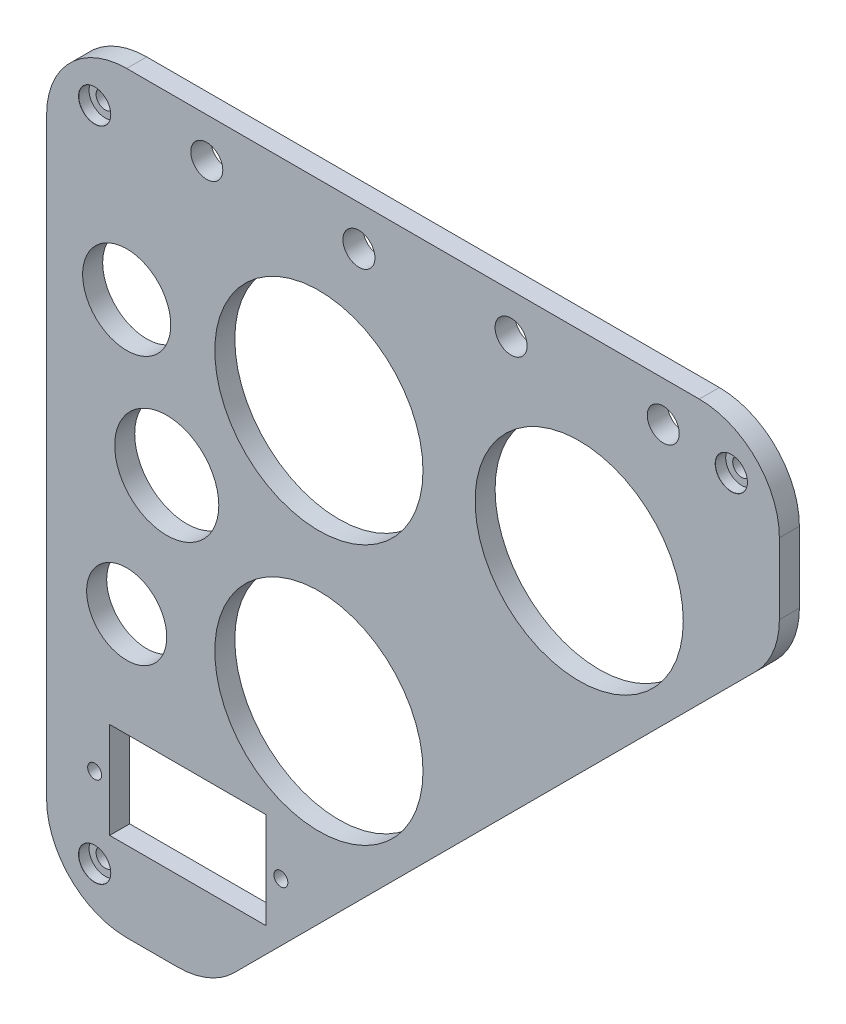
ISO-10303-21;
HEADER;
FILE_DESCRIPTION(('STEP AP214'),'2;1');
FILE_NAME('part.step','',(''),(''),'','','');
FILE_SCHEMA(('AUTOMOTIVE_DESIGN { 1 0 10303 214 1 1 1 1 }'));
ENDSEC;
DATA;
#1=APPLICATION_CONTEXT('core data for automotive mechanical design processes');
#2=APPLICATION_PROTOCOL_DEFINITION('international standard','automotive_design',2000,#1);
#3=PRODUCT_CONTEXT('',#1,'mechanical');
#4=PRODUCT('Part','Part','',(#3));
#5=PRODUCT_RELATED_PRODUCT_CATEGORY('part','',(#4));
#6=PRODUCT_DEFINITION_FORMATION('','',#4);
#7=PRODUCT_DEFINITION_CONTEXT('part definition',#1,'design');
#8=PRODUCT_DEFINITION('design','',#6,#7);
#9=PRODUCT_DEFINITION_SHAPE('','',#8);
#10=(LENGTH_UNIT() NAMED_UNIT(*) SI_UNIT(.MILLI.,.METRE.));
#11=(NAMED_UNIT(*) PLANE_ANGLE_UNIT() SI_UNIT($,.RADIAN.));
#12=(NAMED_UNIT(*) SI_UNIT($,.STERADIAN.) SOLID_ANGLE_UNIT());
#13=UNCERTAINTY_MEASURE_WITH_UNIT(LENGTH_MEASURE(1.E-05),#10,'distance_accuracy_value','');
#14=(GEOMETRIC_REPRESENTATION_CONTEXT(3) GLOBAL_UNCERTAINTY_ASSIGNED_CONTEXT((#13)) GLOBAL_UNIT_ASSIGNED_CONTEXT((#10,
#11,#12)) REPRESENTATION_CONTEXT('',''));
#15=CARTESIAN_POINT('',(0.,0.,0.));
#16=DIRECTION('',(0.,0.,1.));
#17=DIRECTION('',(1.,0.,0.));
#18=AXIS2_PLACEMENT_3D('',#15,#16,#17);
#19=CARTESIAN_POINT('',(20.,168.000000000002,5.));
#20=DIRECTION('',(0.,0.,-1.));
#21=DIRECTION('',(-1.,0.,0.));
#22=AXIS2_PLACEMENT_3D('',#19,#20,#21);
#23=CYLINDRICAL_SURFACE('',#22,20.);
#24=CARTESIAN_POINT('',(20.,168.000000000002,0.));
#25=DIRECTION('',(0.,0.,1.));
#26=DIRECTION('',(-1.,0.,0.));
#27=AXIS2_PLACEMENT_3D('',#24,#25,#26);
#28=CIRCLE('',#27,20.);
#29=CARTESIAN_POINT('',(20.,188.000000000002,0.));
#30=VERTEX_POINT('',#29);
#31=CARTESIAN_POINT('',(0.,168.000000000002,0.));
#32=VERTEX_POINT('',#31);
#33=EDGE_CURVE('E209',#30,#32,#28,.T.);
#34=ORIENTED_EDGE('',*,*,#33,.T.);
#35=DIRECTION('',(0.,0.,-1.));
#36=VECTOR('',#35,1.);
#37=CARTESIAN_POINT('',(0.,168.000000000002,5.));
#38=LINE('',#37,#36);
#39=CARTESIAN_POINT('',(0.,168.000000000002,5.));
#40=VERTEX_POINT('',#39);
#41=EDGE_CURVE('E278',#40,#32,#38,.T.);
#42=ORIENTED_EDGE('',*,*,#41,.F.);
#43=CARTESIAN_POINT('',(20.,168.000000000002,5.));
#44=DIRECTION('',(0.,0.,1.));
#45=DIRECTION('',(-1.,0.,0.));
#46=AXIS2_PLACEMENT_3D('',#43,#44,#45);
#47=CIRCLE('',#46,20.);
#48=CARTESIAN_POINT('',(20.,188.000000000002,5.));
#49=VERTEX_POINT('',#48);
#50=EDGE_CURVE('E210',#49,#40,#47,.T.);
#51=ORIENTED_EDGE('',*,*,#50,.F.);
#52=DIRECTION('',(0.,0.,-1.));
#53=VECTOR('',#52,1.);
#54=CARTESIAN_POINT('',(20.,188.000000000002,5.));
#55=LINE('',#54,#53);
#56=EDGE_CURVE('E232',#49,#30,#55,.T.);
#57=ORIENTED_EDGE('',*,*,#56,.T.);
#58=EDGE_LOOP('',(#34,#42,#51,#57));
#59=FACE_BOUND('',#58,.T.);
#60=ADVANCED_FACE('F34',(#59),#23,.T.);
#61=CARTESIAN_POINT('',(0.,20.0000000000001,5.));
#62=DIRECTION('',(1.,0.,0.));
#63=DIRECTION('',(0.,0.,-1.));
#64=AXIS2_PLACEMENT_3D('',#61,#62,#63);
#65=PLANE('',#64);
#66=DIRECTION('',(0.,-1.,0.));
#67=VECTOR('',#66,1.);
#68=CARTESIAN_POINT('',(0.,20.0000000000001,0.));
#69=LINE('',#68,#67);
#70=CARTESIAN_POINT('',(0.,20.0000000000001,0.));
#71=VERTEX_POINT('',#70);
#72=EDGE_CURVE('E235',#32,#71,#69,.T.);
#73=ORIENTED_EDGE('',*,*,#72,.T.);
#74=DIRECTION('',(0.,0.,-1.));
#75=VECTOR('',#74,1.);
#76=CARTESIAN_POINT('',(0.,20.0000000000001,5.));
#77=LINE('',#76,#75);
#78=CARTESIAN_POINT('',(0.,20.0000000000001,5.));
#79=VERTEX_POINT('',#78);
#80=EDGE_CURVE('E275',#79,#71,#77,.T.);
#81=ORIENTED_EDGE('',*,*,#80,.F.);
#82=DIRECTION('',(0.,-1.,0.));
#83=VECTOR('',#82,1.);
#84=CARTESIAN_POINT('',(0.,20.0000000000001,5.));
#85=LINE('',#84,#83);
#86=EDGE_CURVE('E213',#40,#79,#85,.T.);
#87=ORIENTED_EDGE('',*,*,#86,.F.);
#88=ORIENTED_EDGE('',*,*,#41,.T.);
#89=EDGE_LOOP('',(#73,#81,#87,#88));
#90=FACE_BOUND('',#89,.T.);
#91=ADVANCED_FACE('F404',(#90),#65,.F.);
#92=CARTESIAN_POINT('',(20.,20.,5.));
#93=DIRECTION('',(0.,0.,-1.));
#94=DIRECTION('',(-1.,0.,0.));
#95=AXIS2_PLACEMENT_3D('',#92,#93,#94);
#96=CYLINDRICAL_SURFACE('',#95,20.);
#97=CARTESIAN_POINT('',(20.,20.,0.));
#98=DIRECTION('',(0.,0.,1.));
#99=DIRECTION('',(1.,0.,0.));
#100=AXIS2_PLACEMENT_3D('',#97,#98,#99);
#101=CIRCLE('',#100,20.);
#102=CARTESIAN_POINT('',(20.0000000000001,0.,0.));
#103=VERTEX_POINT('',#102);
#104=EDGE_CURVE('E237',#71,#103,#101,.T.);
#105=ORIENTED_EDGE('',*,*,#104,.T.);
#106=DIRECTION('',(0.,0.,-1.));
#107=VECTOR('',#106,1.);
#108=CARTESIAN_POINT('',(20.0000000000001,0.,5.));
#109=LINE('',#108,#107);
#110=CARTESIAN_POINT('',(20.0000000000001,0.,5.));
#111=VERTEX_POINT('',#110);
#112=EDGE_CURVE('E272',#111,#103,#109,.T.);
#113=ORIENTED_EDGE('',*,*,#112,.F.);
#114=CARTESIAN_POINT('',(20.,20.,5.));
#115=DIRECTION('',(0.,0.,1.));
#116=DIRECTION('',(1.,0.,0.));
#117=AXIS2_PLACEMENT_3D('',#114,#115,#116);
#118=CIRCLE('',#117,20.);
#119=EDGE_CURVE('E216',#79,#111,#118,.T.);
#120=ORIENTED_EDGE('',*,*,#119,.F.);
#121=ORIENTED_EDGE('',*,*,#80,.T.);
#122=EDGE_LOOP('',(#105,#113,#120,#121));
#123=FACE_BOUND('',#122,.T.);
#124=ADVANCED_FACE('F401',(#123),#96,.T.);
#125=CARTESIAN_POINT('',(32.715728752538,0.,5.));
#126=DIRECTION('',(0.,1.,0.));
#127=DIRECTION('',(-1.,0.,0.));
#128=AXIS2_PLACEMENT_3D('',#125,#126,#127);
#129=PLANE('',#128);
#130=DIRECTION('',(1.,0.,0.));
#131=VECTOR('',#130,1.);
#132=CARTESIAN_POINT('',(32.715728752538,0.,0.));
#133=LINE('',#132,#131);
#134=CARTESIAN_POINT('',(32.715728752538,0.,0.));
#135=VERTEX_POINT('',#134);
#136=EDGE_CURVE('E239',#103,#135,#133,.T.);
#137=ORIENTED_EDGE('',*,*,#136,.T.);
#138=DIRECTION('',(0.,0.,-1.));
#139=VECTOR('',#138,1.);
#140=CARTESIAN_POINT('',(32.715728752538,0.,5.));
#141=LINE('',#140,#139);
#142=CARTESIAN_POINT('',(32.715728752538,0.,5.));
#143=VERTEX_POINT('',#142);
#144=EDGE_CURVE('E269',#143,#135,#141,.T.);
#145=ORIENTED_EDGE('',*,*,#144,.F.);
#146=DIRECTION('',(1.,0.,0.));
#147=VECTOR('',#146,1.);
#148=CARTESIAN_POINT('',(32.715728752538,0.,5.));
#149=LINE('',#148,#147);
#150=EDGE_CURVE('E218',#111,#143,#149,.T.);
#151=ORIENTED_EDGE('',*,*,#150,.F.);
#152=ORIENTED_EDGE('',*,*,#112,.T.);
#153=EDGE_LOOP('',(#137,#145,#151,#152));
#154=FACE_BOUND('',#153,.T.);
#155=ADVANCED_FACE('F397',(#154),#129,.F.);
#156=CARTESIAN_POINT('',(32.715728752538,20.,5.));
#157=DIRECTION('',(0.,0.,-1.));
#158=DIRECTION('',(-1.,0.,0.));
#159=AXIS2_PLACEMENT_3D('',#156,#157,#158);
#160=CYLINDRICAL_SURFACE('',#159,20.);
#161=CARTESIAN_POINT('',(32.715728752538,20.,0.));
#162=DIRECTION('',(0.,0.,1.));
#163=DIRECTION('',(-1.,0.,0.));
#164=AXIS2_PLACEMENT_3D('',#161,#162,#163);
#165=CIRCLE('',#164,20.);
#166=CARTESIAN_POINT('',(46.857864376269,5.85786437626913,0.));
#167=VERTEX_POINT('',#166);
#168=EDGE_CURVE('E241',#135,#167,#165,.T.);
#169=ORIENTED_EDGE('',*,*,#168,.T.);
#170=DIRECTION('',(0.,0.,-1.));
#171=VECTOR('',#170,1.);
#172=CARTESIAN_POINT('',(46.857864376269,5.85786437626913,5.));
#173=LINE('',#172,#171);
#174=CARTESIAN_POINT('',(46.857864376269,5.85786437626913,5.));
#175=VERTEX_POINT('',#174);
#176=EDGE_CURVE('E266',#175,#167,#173,.T.);
#177=ORIENTED_EDGE('',*,*,#176,.F.);
#178=CARTESIAN_POINT('',(32.715728752538,20.,5.));
#179=DIRECTION('',(0.,0.,1.));
#180=DIRECTION('',(-1.,0.,0.));
#181=AXIS2_PLACEMENT_3D('',#178,#179,#180);
#182=CIRCLE('',#181,20.);
#183=EDGE_CURVE('E220',#143,#175,#182,.T.);
#184=ORIENTED_EDGE('',*,*,#183,.F.);
#185=ORIENTED_EDGE('',*,*,#144,.T.);
#186=EDGE_LOOP('',(#169,#177,#184,#185));
#187=FACE_BOUND('',#186,.T.);
#188=ADVANCED_FACE('F392',(#187),#160,.T.);
#189=CARTESIAN_POINT('',(177.142135623731,136.142135623733,5.));
#190=DIRECTION('',(-0.707106781186551,0.707106781186544,0.));
#191=DIRECTION('',(-0.707106781186544,-0.707106781186551,0.));
#192=AXIS2_PLACEMENT_3D('',#189,#190,#191);
#193=PLANE('',#192);
#194=DIRECTION('',(0.707106781186544,0.707106781186551,0.));
#195=VECTOR('',#194,1.);
#196=CARTESIAN_POINT('',(177.142135623731,136.142135623733,0.));
#197=LINE('',#196,#195);
#198=CARTESIAN_POINT('',(177.142135623731,136.142135623733,0.));
#199=VERTEX_POINT('',#198);
#200=EDGE_CURVE('E243',#167,#199,#197,.T.);
#201=ORIENTED_EDGE('',*,*,#200,.T.);
#202=DIRECTION('',(0.,0.,-1.));
#203=VECTOR('',#202,1.);
#204=CARTESIAN_POINT('',(177.142135623731,136.142135623733,5.));
#205=LINE('',#204,#203);
#206=CARTESIAN_POINT('',(177.142135623731,136.142135623733,5.));
#207=VERTEX_POINT('',#206);
#208=EDGE_CURVE('E263',#207,#199,#205,.T.);
#209=ORIENTED_EDGE('',*,*,#208,.F.);
#210=DIRECTION('',(0.707106781186544,0.707106781186551,0.));
#211=VECTOR('',#210,1.);
#212=CARTESIAN_POINT('',(177.142135623731,136.142135623733,5.));
#213=LINE('',#212,#211);
#214=EDGE_CURVE('E222',#175,#207,#213,.T.);
#215=ORIENTED_EDGE('',*,*,#214,.F.);
#216=ORIENTED_EDGE('',*,*,#176,.T.);
#217=EDGE_LOOP('',(#201,#209,#215,#216));
#218=FACE_BOUND('',#217,.T.);
#219=ADVANCED_FACE('F387',(#218),#193,.F.);
#220=CARTESIAN_POINT('',(163.,150.284271247463,5.));
#221=DIRECTION('',(0.,0.,-1.));
#222=DIRECTION('',(-1.,0.,0.));
#223=AXIS2_PLACEMENT_3D('',#220,#221,#222);
#224=CYLINDRICAL_SURFACE('',#223,20.);
#225=CARTESIAN_POINT('',(163.,150.284271247463,0.));
#226=DIRECTION('',(0.,0.,1.));
#227=DIRECTION('',(-1.,0.,0.));
#228=AXIS2_PLACEMENT_3D('',#225,#226,#227);
#229=CIRCLE('',#228,20.);
#230=CARTESIAN_POINT('',(183.,150.284271247463,0.));
#231=VERTEX_POINT('',#230);
#232=EDGE_CURVE('E245',#199,#231,#229,.T.);
#233=ORIENTED_EDGE('',*,*,#232,.T.);
#234=DIRECTION('',(0.,0.,-1.));
#235=VECTOR('',#234,1.);
#236=CARTESIAN_POINT('',(183.,150.284271247463,5.));
#237=LINE('',#236,#235);
#238=CARTESIAN_POINT('',(183.,150.284271247463,5.));
#239=VERTEX_POINT('',#238);
#240=EDGE_CURVE('E260',#239,#231,#237,.T.);
#241=ORIENTED_EDGE('',*,*,#240,.F.);
#242=CARTESIAN_POINT('',(163.,150.284271247463,5.));
#243=DIRECTION('',(0.,0.,1.));
#244=DIRECTION('',(-1.,0.,0.));
#245=AXIS2_PLACEMENT_3D('',#242,#243,#244);
#246=CIRCLE('',#245,20.);
#247=EDGE_CURVE('E224',#207,#239,#246,.T.);
#248=ORIENTED_EDGE('',*,*,#247,.F.);
#249=ORIENTED_EDGE('',*,*,#208,.T.);
#250=EDGE_LOOP('',(#233,#241,#248,#249));
#251=FACE_BOUND('',#250,.T.);
#252=ADVANCED_FACE('F383',(#251),#224,.T.);
#253=CARTESIAN_POINT('',(183.,168.000000000002,5.));
#254=DIRECTION('',(-1.,0.,0.));
#255=DIRECTION('',(0.,0.,1.));
#256=AXIS2_PLACEMENT_3D('',#253,#254,#255);
#257=PLANE('',#256);
#258=DIRECTION('',(0.,1.,0.));
#259=VECTOR('',#258,1.);
#260=CARTESIAN_POINT('',(183.,168.000000000002,0.));
#261=LINE('',#260,#259);
#262=CARTESIAN_POINT('',(183.,168.000000000002,0.));
#263=VERTEX_POINT('',#262);
#264=EDGE_CURVE('E247',#231,#263,#261,.T.);
#265=ORIENTED_EDGE('',*,*,#264,.T.);
#266=DIRECTION('',(0.,0.,-1.));
#267=VECTOR('',#266,1.);
#268=CARTESIAN_POINT('',(183.,168.000000000002,5.));
#269=LINE('',#268,#267);
#270=CARTESIAN_POINT('',(183.,168.000000000002,5.));
#271=VERTEX_POINT('',#270);
#272=EDGE_CURVE('E257',#271,#263,#269,.T.);
#273=ORIENTED_EDGE('',*,*,#272,.F.);
#274=DIRECTION('',(0.,1.,0.));
#275=VECTOR('',#274,1.);
#276=CARTESIAN_POINT('',(183.,168.000000000002,5.));
#277=LINE('',#276,#275);
#278=EDGE_CURVE('E226',#239,#271,#277,.T.);
#279=ORIENTED_EDGE('',*,*,#278,.F.);
#280=ORIENTED_EDGE('',*,*,#240,.T.);
#281=EDGE_LOOP('',(#265,#273,#279,#280));
#282=FACE_BOUND('',#281,.T.);
#283=ADVANCED_FACE('F378',(#282),#257,.F.);
#284=CARTESIAN_POINT('',(163.,168.000000000002,5.));
#285=DIRECTION('',(0.,0.,-1.));
#286=DIRECTION('',(-1.,0.,0.));
#287=AXIS2_PLACEMENT_3D('',#284,#285,#286);
#288=CYLINDRICAL_SURFACE('',#287,20.);
#289=CARTESIAN_POINT('',(163.,168.000000000002,0.));
#290=DIRECTION('',(0.,0.,1.));
#291=DIRECTION('',(-1.,0.,0.));
#292=AXIS2_PLACEMENT_3D('',#289,#290,#291);
#293=CIRCLE('',#292,20.);
#294=CARTESIAN_POINT('',(163.,188.000000000002,0.));
#295=VERTEX_POINT('',#294);
#296=EDGE_CURVE('E249',#263,#295,#293,.T.);
#297=ORIENTED_EDGE('',*,*,#296,.T.);
#298=DIRECTION('',(0.,0.,-1.));
#299=VECTOR('',#298,1.);
#300=CARTESIAN_POINT('',(163.,188.000000000002,5.));
#301=LINE('',#300,#299);
#302=CARTESIAN_POINT('',(163.,188.000000000002,5.));
#303=VERTEX_POINT('',#302);
#304=EDGE_CURVE('E254',#303,#295,#301,.T.);
#305=ORIENTED_EDGE('',*,*,#304,.F.);
#306=CARTESIAN_POINT('',(163.,168.000000000002,5.));
#307=DIRECTION('',(0.,0.,1.));
#308=DIRECTION('',(-1.,0.,0.));
#309=AXIS2_PLACEMENT_3D('',#306,#307,#308);
#310=CIRCLE('',#309,20.);
#311=EDGE_CURVE('E228',#271,#303,#310,.T.);
#312=ORIENTED_EDGE('',*,*,#311,.F.);
#313=ORIENTED_EDGE('',*,*,#272,.T.);
#314=EDGE_LOOP('',(#297,#305,#312,#313));
#315=FACE_BOUND('',#314,.T.);
#316=ADVANCED_FACE('F372',(#315),#288,.T.);
#317=CARTESIAN_POINT('',(20.,188.000000000002,5.));
#318=DIRECTION('',(0.,-1.,0.));
#319=DIRECTION('',(0.,0.,-1.));
#320=AXIS2_PLACEMENT_3D('',#317,#318,#319);
#321=PLANE('',#320);
#322=DIRECTION('',(-1.,0.,0.));
#323=VECTOR('',#322,1.);
#324=CARTESIAN_POINT('',(20.,188.000000000002,0.));
#325=LINE('',#324,#323);
#326=EDGE_CURVE('E214',#295,#30,#325,.T.);
#327=ORIENTED_EDGE('',*,*,#326,.T.);
#328=ORIENTED_EDGE('',*,*,#56,.F.);
#329=DIRECTION('',(-1.,0.,0.));
#330=VECTOR('',#329,1.);
#331=CARTESIAN_POINT('',(20.,188.000000000002,5.));
#332=LINE('',#331,#330);
#333=EDGE_CURVE('E230',#303,#49,#332,.T.);
#334=ORIENTED_EDGE('',*,*,#333,.F.);
#335=ORIENTED_EDGE('',*,*,#304,.T.);
#336=EDGE_LOOP('',(#327,#328,#334,#335));
#337=FACE_BOUND('',#336,.T.);
#338=ADVANCED_FACE('F368',(#337),#321,.F.);
#339=CARTESIAN_POINT('',(20.,168.000000000002,5.));
#340=DIRECTION('',(0.,0.,-1.));
#341=DIRECTION('',(-1.,0.,0.));
#342=AXIS2_PLACEMENT_3D('',#339,#340,#341);
#343=PLANE('',#342);
#344=CARTESIAN_POINT('',(78.,178.000000000002,5.));
#345=DIRECTION('',(0.,0.,1.));
#346=DIRECTION('',(1.,0.,0.));
#347=AXIS2_PLACEMENT_3D('',#344,#345,#346);
#348=CIRCLE('',#347,3.99999999999999);
#349=CARTESIAN_POINT('',(82.,178.000000000002,5.));
#350=VERTEX_POINT('',#349);
#351=EDGE_CURVE('E730',#350,#350,#348,.T.);
#352=ORIENTED_EDGE('',*,*,#351,.F.);
#353=EDGE_LOOP('',(#352));
#354=FACE_BOUND('',#353,.T.);
#355=CARTESIAN_POINT('',(133.,138.000000000002,5.));
#356=DIRECTION('',(0.,0.,1.));
#357=DIRECTION('',(1.,0.,0.));
#358=AXIS2_PLACEMENT_3D('',#355,#356,#357);
#359=CIRCLE('',#358,26.);
#360=CARTESIAN_POINT('',(159.,138.000000000002,5.));
#361=VERTEX_POINT('',#360);
#362=EDGE_CURVE('E729',#361,#361,#359,.T.);
#363=ORIENTED_EDGE('',*,*,#362,.F.);
#364=EDGE_LOOP('',(#363));
#365=FACE_BOUND('',#364,.T.);
#366=CARTESIAN_POINT('',(30.,105.000000000002,5.));
#367=DIRECTION('',(0.,0.,1.));
#368=DIRECTION('',(1.,0.,0.));
#369=AXIS2_PLACEMENT_3D('',#366,#367,#368);
#370=CIRCLE('',#369,13.);
#371=CARTESIAN_POINT('',(43.,105.000000000002,5.));
#372=VERTEX_POINT('',#371);
#373=EDGE_CURVE('E731',#372,#372,#370,.T.);
#374=ORIENTED_EDGE('',*,*,#373,.F.);
#375=EDGE_LOOP('',(#374));
#376=FACE_BOUND('',#375,.T.);
#377=CARTESIAN_POINT('',(116.,178.000000000002,5.));
#378=DIRECTION('',(0.,0.,1.));
#379=DIRECTION('',(1.,0.,0.));
#380=AXIS2_PLACEMENT_3D('',#377,#378,#379);
#381=CIRCLE('',#380,3.99999999999993);
#382=CARTESIAN_POINT('',(120.,178.000000000002,5.));
#383=VERTEX_POINT('',#382);
#384=EDGE_CURVE('E737',#383,#383,#381,.T.);
#385=ORIENTED_EDGE('',*,*,#384,.F.);
#386=EDGE_LOOP('',(#385));
#387=FACE_BOUND('',#386,.T.);
#388=CARTESIAN_POINT('',(20.,138.000000000002,5.));
#389=DIRECTION('',(0.,0.,1.));
#390=DIRECTION('',(1.,0.,0.));
#391=AXIS2_PLACEMENT_3D('',#388,#389,#390);
#392=CIRCLE('',#391,11.);
#393=CARTESIAN_POINT('',(31.,138.000000000002,5.));
#394=VERTEX_POINT('',#393);
#395=EDGE_CURVE('E734',#394,#394,#392,.T.);
#396=ORIENTED_EDGE('',*,*,#395,.F.);
#397=EDGE_LOOP('',(#396));
#398=FACE_BOUND('',#397,.T.);
#399=CARTESIAN_POINT('',(20.,70.0000000000016,5.));
#400=DIRECTION('',(0.,0.,1.));
#401=DIRECTION('',(1.,0.,0.));
#402=AXIS2_PLACEMENT_3D('',#399,#400,#401);
#403=CIRCLE('',#402,10.);
#404=CARTESIAN_POINT('',(30.,70.0000000000016,5.));
#405=VERTEX_POINT('',#404);
#406=EDGE_CURVE('E747',#405,#405,#403,.T.);
#407=ORIENTED_EDGE('',*,*,#406,.F.);
#408=EDGE_LOOP('',(#407));
#409=FACE_BOUND('',#408,.T.);
#410=CARTESIAN_POINT('',(58.5,32.,5.));
#411=DIRECTION('',(0.,0.,1.));
#412=DIRECTION('',(1.,0.,0.));
#413=AXIS2_PLACEMENT_3D('',#410,#411,#412);
#414=CIRCLE('',#413,1.75);
#415=CARTESIAN_POINT('',(60.25,32.,5.));
#416=VERTEX_POINT('',#415);
#417=EDGE_CURVE('E744',#416,#416,#414,.T.);
#418=ORIENTED_EDGE('',*,*,#417,.F.);
#419=EDGE_LOOP('',(#418));
#420=FACE_BOUND('',#419,.T.);
#421=CARTESIAN_POINT('',(12.,32.,5.));
#422=DIRECTION('',(0.,0.,1.));
#423=DIRECTION('',(1.,0.,0.));
#424=AXIS2_PLACEMENT_3D('',#421,#422,#423);
#425=CIRCLE('',#424,1.75000000000001);
#426=CARTESIAN_POINT('',(13.75,32.,5.));
#427=VERTEX_POINT('',#426);
#428=EDGE_CURVE('E741',#427,#427,#425,.T.);
#429=ORIENTED_EDGE('',*,*,#428,.F.);
#430=EDGE_LOOP('',(#429));
#431=FACE_BOUND('',#430,.T.);
#432=CARTESIAN_POINT('',(40.,178.000000000002,5.));
#433=DIRECTION('',(0.,0.,1.));
#434=DIRECTION('',(1.,0.,0.));
#435=AXIS2_PLACEMENT_3D('',#432,#433,#434);
#436=CIRCLE('',#435,4.00000000000001);
#437=CARTESIAN_POINT('',(44.,178.000000000002,5.));
#438=VERTEX_POINT('',#437);
#439=EDGE_CURVE('E764',#438,#438,#436,.T.);
#440=ORIENTED_EDGE('',*,*,#439,.F.);
#441=EDGE_LOOP('',(#440));
#442=FACE_BOUND('',#441,.T.);
#443=CARTESIAN_POINT('',(154.,178.000000000002,5.));
#444=DIRECTION('',(0.,0.,1.));
#445=DIRECTION('',(1.,0.,0.));
#446=AXIS2_PLACEMENT_3D('',#443,#444,#445);
#447=CIRCLE('',#446,3.99999999999999);
#448=CARTESIAN_POINT('',(158.,178.000000000002,5.));
#449=VERTEX_POINT('',#448);
#450=EDGE_CURVE('E768',#449,#449,#447,.T.);
#451=ORIENTED_EDGE('',*,*,#450,.F.);
#452=EDGE_LOOP('',(#451));
#453=FACE_BOUND('',#452,.T.);
#454=CARTESIAN_POINT('',(68.,73.0000000000016,5.));
#455=DIRECTION('',(0.,0.,1.));
#456=DIRECTION('',(1.,0.,0.));
#457=AXIS2_PLACEMENT_3D('',#454,#455,#456);
#458=CIRCLE('',#457,26.);
#459=CARTESIAN_POINT('',(94.0000000000001,73.0000000000016,5.));
#460=VERTEX_POINT('',#459);
#461=EDGE_CURVE('E772',#460,#460,#458,.T.);
#462=ORIENTED_EDGE('',*,*,#461,.F.);
#463=EDGE_LOOP('',(#462));
#464=FACE_BOUND('',#463,.T.);
#465=CARTESIAN_POINT('',(68.,138.000000000002,5.));
#466=DIRECTION('',(0.,0.,1.));
#467=DIRECTION('',(1.,0.,0.));
#468=AXIS2_PLACEMENT_3D('',#465,#466,#467);
#469=CIRCLE('',#468,26.);
#470=CARTESIAN_POINT('',(94.,138.000000000002,5.));
#471=VERTEX_POINT('',#470);
#472=EDGE_CURVE('E775',#471,#471,#469,.T.);
#473=ORIENTED_EDGE('',*,*,#472,.F.);
#474=EDGE_LOOP('',(#473));
#475=FACE_BOUND('',#474,.T.);
#476=DIRECTION('',(0.,1.,0.));
#477=VECTOR('',#476,1.);
#478=CARTESIAN_POINT('',(54.75,44.,5.));
#479=LINE('',#478,#477);
#480=CARTESIAN_POINT('',(54.75,20.,5.));
#481=VERTEX_POINT('',#480);
#482=CARTESIAN_POINT('',(54.75,44.,5.));
#483=VERTEX_POINT('',#482);
#484=EDGE_CURVE('E147',#481,#483,#479,.T.);
#485=ORIENTED_EDGE('',*,*,#484,.F.);
#486=DIRECTION('',(1.,0.,0.));
#487=VECTOR('',#486,1.);
#488=CARTESIAN_POINT('',(54.75,20.,5.));
#489=LINE('',#488,#487);
#490=CARTESIAN_POINT('',(15.75,20.,5.));
#491=VERTEX_POINT('',#490);
#492=EDGE_CURVE('E50',#491,#481,#489,.T.);
#493=ORIENTED_EDGE('',*,*,#492,.F.);
#494=DIRECTION('',(0.,-1.,0.));
#495=VECTOR('',#494,1.);
#496=CARTESIAN_POINT('',(15.75,20.,5.));
#497=LINE('',#496,#495);
#498=CARTESIAN_POINT('',(15.75,44.,5.));
#499=VERTEX_POINT('',#498);
#500=EDGE_CURVE('E154',#499,#491,#497,.T.);
#501=ORIENTED_EDGE('',*,*,#500,.F.);
#502=DIRECTION('',(-1.,0.,0.));
#503=VECTOR('',#502,1.);
#504=CARTESIAN_POINT('',(15.75,44.,5.));
#505=LINE('',#504,#503);
#506=EDGE_CURVE('E138',#483,#499,#505,.T.);
#507=ORIENTED_EDGE('',*,*,#506,.F.);
#508=EDGE_LOOP('',(#485,#493,#501,#507));
#509=FACE_BOUND('',#508,.T.);
#510=CARTESIAN_POINT('',(12.,176.000000000002,5.));
#511=DIRECTION('',(0.,0.,1.));
#512=DIRECTION('',(1.,0.,0.));
#513=AXIS2_PLACEMENT_3D('',#510,#511,#512);
#514=CIRCLE('',#513,4.025);
#515=CARTESIAN_POINT('',(16.025,176.000000000002,5.));
#516=VERTEX_POINT('',#515);
#517=EDGE_CURVE('E164',#516,#516,#514,.T.);
#518=ORIENTED_EDGE('',*,*,#517,.F.);
#519=EDGE_LOOP('',(#518));
#520=FACE_BOUND('',#519,.T.);
#521=CARTESIAN_POINT('',(12.,12.,5.));
#522=DIRECTION('',(0.,0.,1.));
#523=DIRECTION('',(1.,0.,0.));
#524=AXIS2_PLACEMENT_3D('',#521,#522,#523);
#525=CIRCLE('',#524,4.025);
#526=CARTESIAN_POINT('',(16.025,12.,5.));
#527=VERTEX_POINT('',#526);
#528=EDGE_CURVE('E179',#527,#527,#525,.T.);
#529=ORIENTED_EDGE('',*,*,#528,.F.);
#530=EDGE_LOOP('',(#529));
#531=FACE_BOUND('',#530,.T.);
#532=CARTESIAN_POINT('',(171.,176.000000000002,5.));
#533=DIRECTION('',(0.,0.,1.));
#534=DIRECTION('',(1.,0.,0.));
#535=AXIS2_PLACEMENT_3D('',#532,#533,#534);
#536=CIRCLE('',#535,4.025);
#537=CARTESIAN_POINT('',(175.025,176.000000000002,5.));
#538=VERTEX_POINT('',#537);
#539=EDGE_CURVE('E194',#538,#538,#536,.T.);
#540=ORIENTED_EDGE('',*,*,#539,.F.);
#541=EDGE_LOOP('',(#540));
#542=FACE_BOUND('',#541,.T.);
#543=ORIENTED_EDGE('',*,*,#50,.T.);
#544=ORIENTED_EDGE('',*,*,#86,.T.);
#545=ORIENTED_EDGE('',*,*,#119,.T.);
#546=ORIENTED_EDGE('',*,*,#150,.T.);
#547=ORIENTED_EDGE('',*,*,#183,.T.);
#548=ORIENTED_EDGE('',*,*,#214,.T.);
#549=ORIENTED_EDGE('',*,*,#247,.T.);
#550=ORIENTED_EDGE('',*,*,#278,.T.);
#551=ORIENTED_EDGE('',*,*,#311,.T.);
#552=ORIENTED_EDGE('',*,*,#333,.T.);
#553=EDGE_LOOP('',(#543,#544,#545,#546,#547,#548,#549,#550,#551,#552));
#554=FACE_BOUND('',#553,.T.);
#555=ADVANCED_FACE('F151',(#354,#365,#376,#387,#398,#409,#420,#431,#442,#453,#464,#475,#509,
#520,#531,#542,#554),#343,.F.);
#556=CARTESIAN_POINT('',(20.,168.000000000002,0.));
#557=DIRECTION('',(0.,0.,-1.));
#558=DIRECTION('',(-1.,0.,0.));
#559=AXIS2_PLACEMENT_3D('',#556,#557,#558);
#560=PLANE('',#559);
#561=CARTESIAN_POINT('',(78.,178.000000000002,0.));
#562=DIRECTION('',(0.,0.,-1.));
#563=DIRECTION('',(-1.,0.,0.));
#564=AXIS2_PLACEMENT_3D('',#561,#562,#563);
#565=CIRCLE('',#564,3.99999999999999);
#566=CARTESIAN_POINT('',(74.,178.000000000002,0.));
#567=VERTEX_POINT('',#566);
#568=EDGE_CURVE('E37',#567,#567,#565,.T.);
#569=ORIENTED_EDGE('',*,*,#568,.F.);
#570=EDGE_LOOP('',(#569));
#571=FACE_BOUND('',#570,.T.);
#572=CARTESIAN_POINT('',(133.,138.000000000002,0.));
#573=DIRECTION('',(0.,0.,-1.));
#574=DIRECTION('',(-1.,0.,0.));
#575=AXIS2_PLACEMENT_3D('',#572,#573,#574);
#576=CIRCLE('',#575,26.);
#577=CARTESIAN_POINT('',(107.,138.000000000002,0.));
#578=VERTEX_POINT('',#577);
#579=EDGE_CURVE('E313',#578,#578,#576,.T.);
#580=ORIENTED_EDGE('',*,*,#579,.F.);
#581=EDGE_LOOP('',(#580));
#582=FACE_BOUND('',#581,.T.);
#583=CARTESIAN_POINT('',(30.,105.000000000002,0.));
#584=DIRECTION('',(0.,0.,-1.));
#585=DIRECTION('',(-1.,0.,0.));
#586=AXIS2_PLACEMENT_3D('',#583,#584,#585);
#587=CIRCLE('',#586,13.);
#588=CARTESIAN_POINT('',(17.,105.000000000002,0.));
#589=VERTEX_POINT('',#588);
#590=EDGE_CURVE('E311',#589,#589,#587,.T.);
#591=ORIENTED_EDGE('',*,*,#590,.F.);
#592=EDGE_LOOP('',(#591));
#593=FACE_BOUND('',#592,.T.);
#594=CARTESIAN_POINT('',(116.,178.000000000002,0.));
#595=DIRECTION('',(0.,0.,-1.));
#596=DIRECTION('',(-1.,0.,0.));
#597=AXIS2_PLACEMENT_3D('',#594,#595,#596);
#598=CIRCLE('',#597,3.99999999999993);
#599=CARTESIAN_POINT('',(112.,178.000000000002,0.));
#600=VERTEX_POINT('',#599);
#601=EDGE_CURVE('E308',#600,#600,#598,.T.);
#602=ORIENTED_EDGE('',*,*,#601,.F.);
#603=EDGE_LOOP('',(#602));
#604=FACE_BOUND('',#603,.T.);
#605=CARTESIAN_POINT('',(20.,138.000000000002,0.));
#606=DIRECTION('',(0.,0.,-1.));
#607=DIRECTION('',(-1.,0.,0.));
#608=AXIS2_PLACEMENT_3D('',#605,#606,#607);
#609=CIRCLE('',#608,11.);
#610=CARTESIAN_POINT('',(8.99999999999999,138.000000000002,0.));
#611=VERTEX_POINT('',#610);
#612=EDGE_CURVE('E305',#611,#611,#609,.T.);
#613=ORIENTED_EDGE('',*,*,#612,.F.);
#614=EDGE_LOOP('',(#613));
#615=FACE_BOUND('',#614,.T.);
#616=CARTESIAN_POINT('',(20.,70.0000000000016,0.));
#617=DIRECTION('',(0.,0.,-1.));
#618=DIRECTION('',(-1.,0.,0.));
#619=AXIS2_PLACEMENT_3D('',#616,#617,#618);
#620=CIRCLE('',#619,10.);
#621=CARTESIAN_POINT('',(9.99999999999997,70.0000000000016,0.));
#622=VERTEX_POINT('',#621);
#623=EDGE_CURVE('E302',#622,#622,#620,.T.);
#624=ORIENTED_EDGE('',*,*,#623,.F.);
#625=EDGE_LOOP('',(#624));
#626=FACE_BOUND('',#625,.T.);
#627=CARTESIAN_POINT('',(58.5,32.,0.));
#628=DIRECTION('',(0.,0.,-1.));
#629=DIRECTION('',(-1.,0.,0.));
#630=AXIS2_PLACEMENT_3D('',#627,#628,#629);
#631=CIRCLE('',#630,1.75);
#632=CARTESIAN_POINT('',(56.75,32.,0.));
#633=VERTEX_POINT('',#632);
#634=EDGE_CURVE('E299',#633,#633,#631,.T.);
#635=ORIENTED_EDGE('',*,*,#634,.F.);
#636=EDGE_LOOP('',(#635));
#637=FACE_BOUND('',#636,.T.);
#638=CARTESIAN_POINT('',(12.,32.,0.));
#639=DIRECTION('',(0.,0.,-1.));
#640=DIRECTION('',(-1.,0.,0.));
#641=AXIS2_PLACEMENT_3D('',#638,#639,#640);
#642=CIRCLE('',#641,1.75000000000001);
#643=CARTESIAN_POINT('',(10.25,32.,0.));
#644=VERTEX_POINT('',#643);
#645=EDGE_CURVE('E296',#644,#644,#642,.T.);
#646=ORIENTED_EDGE('',*,*,#645,.F.);
#647=EDGE_LOOP('',(#646));
#648=FACE_BOUND('',#647,.T.);
#649=CARTESIAN_POINT('',(40.,178.000000000002,0.));
#650=DIRECTION('',(0.,0.,-1.));
#651=DIRECTION('',(-1.,0.,0.));
#652=AXIS2_PLACEMENT_3D('',#649,#650,#651);
#653=CIRCLE('',#652,4.00000000000001);
#654=CARTESIAN_POINT('',(36.,178.000000000002,0.));
#655=VERTEX_POINT('',#654);
#656=EDGE_CURVE('E293',#655,#655,#653,.T.);
#657=ORIENTED_EDGE('',*,*,#656,.F.);
#658=EDGE_LOOP('',(#657));
#659=FACE_BOUND('',#658,.T.);
#660=CARTESIAN_POINT('',(154.,178.000000000002,0.));
#661=DIRECTION('',(0.,0.,-1.));
#662=DIRECTION('',(-1.,0.,0.));
#663=AXIS2_PLACEMENT_3D('',#660,#661,#662);
#664=CIRCLE('',#663,3.99999999999999);
#665=CARTESIAN_POINT('',(150.,178.000000000002,0.));
#666=VERTEX_POINT('',#665);
#667=EDGE_CURVE('E290',#666,#666,#664,.T.);
#668=ORIENTED_EDGE('',*,*,#667,.F.);
#669=EDGE_LOOP('',(#668));
#670=FACE_BOUND('',#669,.T.);
#671=CARTESIAN_POINT('',(68.,73.0000000000016,0.));
#672=DIRECTION('',(0.,0.,-1.));
#673=DIRECTION('',(-1.,0.,0.));
#674=AXIS2_PLACEMENT_3D('',#671,#672,#673);
#675=CIRCLE('',#674,26.);
#676=CARTESIAN_POINT('',(42.,73.0000000000016,0.));
#677=VERTEX_POINT('',#676);
#678=EDGE_CURVE('E287',#677,#677,#675,.T.);
#679=ORIENTED_EDGE('',*,*,#678,.F.);
#680=EDGE_LOOP('',(#679));
#681=FACE_BOUND('',#680,.T.);
#682=CARTESIAN_POINT('',(68.,138.000000000002,0.));
#683=DIRECTION('',(0.,0.,-1.));
#684=DIRECTION('',(-1.,0.,0.));
#685=AXIS2_PLACEMENT_3D('',#682,#683,#684);
#686=CIRCLE('',#685,26.);
#687=CARTESIAN_POINT('',(42.,138.000000000002,0.));
#688=VERTEX_POINT('',#687);
#689=EDGE_CURVE('E161',#688,#688,#686,.T.);
#690=ORIENTED_EDGE('',*,*,#689,.F.);
#691=EDGE_LOOP('',(#690));
#692=FACE_BOUND('',#691,.T.);
#693=DIRECTION('',(-1.,0.,0.));
#694=VECTOR('',#693,1.);
#695=CARTESIAN_POINT('',(20.,20.,0.));
#696=LINE('',#695,#694);
#697=CARTESIAN_POINT('',(54.75,20.,0.));
#698=VERTEX_POINT('',#697);
#699=CARTESIAN_POINT('',(15.75,20.,0.));
#700=VERTEX_POINT('',#699);
#701=EDGE_CURVE('E11',#698,#700,#696,.T.);
#702=ORIENTED_EDGE('',*,*,#701,.F.);
#703=DIRECTION('',(0.,-1.,0.));
#704=VECTOR('',#703,1.);
#705=CARTESIAN_POINT('',(54.75,168.000000000002,0.));
#706=LINE('',#705,#704);
#707=CARTESIAN_POINT('',(54.75,44.,0.));
#708=VERTEX_POINT('',#707);
#709=EDGE_CURVE('E281',#708,#698,#706,.T.);
#710=ORIENTED_EDGE('',*,*,#709,.F.);
#711=DIRECTION('',(1.,0.,0.));
#712=VECTOR('',#711,1.);
#713=CARTESIAN_POINT('',(20.,44.,0.));
#714=LINE('',#713,#712);
#715=CARTESIAN_POINT('',(15.75,44.,0.));
#716=VERTEX_POINT('',#715);
#717=EDGE_CURVE('E141',#716,#708,#714,.T.);
#718=ORIENTED_EDGE('',*,*,#717,.F.);
#719=DIRECTION('',(0.,1.,0.));
#720=VECTOR('',#719,1.);
#721=CARTESIAN_POINT('',(15.75,168.000000000002,0.));
#722=LINE('',#721,#720);
#723=EDGE_CURVE('E42',#700,#716,#722,.T.);
#724=ORIENTED_EDGE('',*,*,#723,.F.);
#725=EDGE_LOOP('',(#702,#710,#718,#724));
#726=FACE_BOUND('',#725,.T.);
#727=CARTESIAN_POINT('',(12.,176.000000000002,0.));
#728=DIRECTION('',(0.,0.,1.));
#729=DIRECTION('',(1.,0.,0.));
#730=AXIS2_PLACEMENT_3D('',#727,#728,#729);
#731=CIRCLE('',#730,2.25);
#732=CARTESIAN_POINT('',(14.25,176.000000000002,0.));
#733=VERTEX_POINT('',#732);
#734=EDGE_CURVE('E176',#733,#733,#731,.T.);
#735=ORIENTED_EDGE('',*,*,#734,.T.);
#736=EDGE_LOOP('',(#735));
#737=FACE_BOUND('',#736,.T.);
#738=CARTESIAN_POINT('',(12.,12.,0.));
#739=DIRECTION('',(0.,0.,1.));
#740=DIRECTION('',(1.,0.,0.));
#741=AXIS2_PLACEMENT_3D('',#738,#739,#740);
#742=CIRCLE('',#741,2.25);
#743=CARTESIAN_POINT('',(14.25,12.,0.));
#744=VERTEX_POINT('',#743);
#745=EDGE_CURVE('E191',#744,#744,#742,.T.);
#746=ORIENTED_EDGE('',*,*,#745,.T.);
#747=EDGE_LOOP('',(#746));
#748=FACE_BOUND('',#747,.T.);
#749=CARTESIAN_POINT('',(171.,176.000000000002,0.));
#750=DIRECTION('',(0.,0.,1.));
#751=DIRECTION('',(1.,0.,0.));
#752=AXIS2_PLACEMENT_3D('',#749,#750,#751);
#753=CIRCLE('',#752,2.25);
#754=CARTESIAN_POINT('',(173.25,176.000000000002,0.));
#755=VERTEX_POINT('',#754);
#756=EDGE_CURVE('E206',#755,#755,#753,.T.);
#757=ORIENTED_EDGE('',*,*,#756,.T.);
#758=EDGE_LOOP('',(#757));
#759=FACE_BOUND('',#758,.T.);
#760=ORIENTED_EDGE('',*,*,#33,.F.);
#761=ORIENTED_EDGE('',*,*,#326,.F.);
#762=ORIENTED_EDGE('',*,*,#296,.F.);
#763=ORIENTED_EDGE('',*,*,#264,.F.);
#764=ORIENTED_EDGE('',*,*,#232,.F.);
#765=ORIENTED_EDGE('',*,*,#200,.F.);
#766=ORIENTED_EDGE('',*,*,#168,.F.);
#767=ORIENTED_EDGE('',*,*,#136,.F.);
#768=ORIENTED_EDGE('',*,*,#104,.F.);
#769=ORIENTED_EDGE('',*,*,#72,.F.);
#770=EDGE_LOOP('',(#760,#761,#762,#763,#764,#765,#766,#767,#768,#769));
#771=FACE_BOUND('',#770,.T.);
#772=ADVANCED_FACE('F323',(#571,#582,#593,#604,#615,#626,#637,#648,#659,#670,#681,#692,#726,
#737,#748,#759,#771),#560,.T.);
#773=CARTESIAN_POINT('',(171.,176.000000000002,5.));
#774=DIRECTION('',(0.,0.,1.));
#775=DIRECTION('',(1.,0.,0.));
#776=AXIS2_PLACEMENT_3D('',#773,#774,#775);
#777=CYLINDRICAL_SURFACE('',#776,2.25);
#778=ORIENTED_EDGE('',*,*,#756,.F.);
#779=EDGE_LOOP('',(#778));
#780=FACE_BOUND('',#779,.T.);
#781=CARTESIAN_POINT('',(171.,176.000000000002,2.4));
#782=DIRECTION('',(0.,0.,1.));
#783=DIRECTION('',(1.,0.,0.));
#784=AXIS2_PLACEMENT_3D('',#781,#782,#783);
#785=CIRCLE('',#784,2.25);
#786=CARTESIAN_POINT('',(173.25,176.000000000002,2.4));
#787=VERTEX_POINT('',#786);
#788=EDGE_CURVE('E203',#787,#787,#785,.T.);
#789=ORIENTED_EDGE('',*,*,#788,.T.);
#790=EDGE_LOOP('',(#789));
#791=FACE_BOUND('',#790,.T.);
#792=ADVANCED_FACE('F326',(#780,#791),#777,.F.);
#793=CARTESIAN_POINT('',(175.,176.000000000002,2.4));
#794=DIRECTION('',(0.,0.,-1.));
#795=DIRECTION('',(-1.,0.,0.));
#796=AXIS2_PLACEMENT_3D('',#793,#794,#795);
#797=PLANE('',#796);
#798=ORIENTED_EDGE('',*,*,#788,.F.);
#799=EDGE_LOOP('',(#798));
#800=FACE_BOUND('',#799,.T.);
#801=CARTESIAN_POINT('',(171.,176.000000000002,2.4));
#802=DIRECTION('',(0.,0.,1.));
#803=DIRECTION('',(1.,0.,0.));
#804=AXIS2_PLACEMENT_3D('',#801,#802,#803);
#805=CIRCLE('',#804,4.);
#806=CARTESIAN_POINT('',(175.,176.000000000002,2.4));
#807=VERTEX_POINT('',#806);
#808=EDGE_CURVE('E200',#807,#807,#805,.T.);
#809=ORIENTED_EDGE('',*,*,#808,.T.);
#810=EDGE_LOOP('',(#809));
#811=FACE_BOUND('',#810,.T.);
#812=ADVANCED_FACE('F463',(#800,#811),#797,.F.);
#813=CARTESIAN_POINT('',(171.,176.000000000002,5.));
#814=DIRECTION('',(0.,0.,1.));
#815=DIRECTION('',(1.,0.,0.));
#816=AXIS2_PLACEMENT_3D('',#813,#814,#815);
#817=CYLINDRICAL_SURFACE('',#816,4.);
#818=ORIENTED_EDGE('',*,*,#808,.F.);
#819=EDGE_LOOP('',(#818));
#820=FACE_BOUND('',#819,.T.);
#821=CARTESIAN_POINT('',(171.,176.000000000002,4.975));
#822=DIRECTION('',(0.,0.,1.));
#823=DIRECTION('',(1.,0.,0.));
#824=AXIS2_PLACEMENT_3D('',#821,#822,#823);
#825=CIRCLE('',#824,4.);
#826=CARTESIAN_POINT('',(175.,176.000000000002,4.975));
#827=VERTEX_POINT('',#826);
#828=EDGE_CURVE('E197',#827,#827,#825,.T.);
#829=ORIENTED_EDGE('',*,*,#828,.T.);
#830=EDGE_LOOP('',(#829));
#831=FACE_BOUND('',#830,.T.);
#832=ADVANCED_FACE('F469',(#820,#831),#817,.F.);
#833=CARTESIAN_POINT('',(171.,176.000000000002,5.));
#834=DIRECTION('',(0.,0.,1.));
#835=DIRECTION('',(1.,0.,0.));
#836=AXIS2_PLACEMENT_3D('',#833,#834,#835);
#837=CONICAL_SURFACE('',#836,4.025,0.785398163397396);
#838=ORIENTED_EDGE('',*,*,#828,.F.);
#839=EDGE_LOOP('',(#838));
#840=FACE_BOUND('',#839,.T.);
#841=ORIENTED_EDGE('',*,*,#539,.T.);
#842=EDGE_LOOP('',(#841));
#843=FACE_BOUND('',#842,.T.);
#844=ADVANCED_FACE('F477',(#840,#843),#837,.F.);
#845=CARTESIAN_POINT('',(12.,12.,5.));
#846=DIRECTION('',(0.,0.,1.));
#847=DIRECTION('',(1.,0.,0.));
#848=AXIS2_PLACEMENT_3D('',#845,#846,#847);
#849=CYLINDRICAL_SURFACE('',#848,2.25);
#850=ORIENTED_EDGE('',*,*,#745,.F.);
#851=EDGE_LOOP('',(#850));
#852=FACE_BOUND('',#851,.T.);
#853=CARTESIAN_POINT('',(12.,12.,2.4));
#854=DIRECTION('',(0.,0.,1.));
#855=DIRECTION('',(1.,0.,0.));
#856=AXIS2_PLACEMENT_3D('',#853,#854,#855);
#857=CIRCLE('',#856,2.25);
#858=CARTESIAN_POINT('',(14.25,12.,2.4));
#859=VERTEX_POINT('',#858);
#860=EDGE_CURVE('E188',#859,#859,#857,.T.);
#861=ORIENTED_EDGE('',*,*,#860,.T.);
#862=EDGE_LOOP('',(#861));
#863=FACE_BOUND('',#862,.T.);
#864=ADVANCED_FACE('F485',(#852,#863),#849,.F.);
#865=CARTESIAN_POINT('',(16.,12.,2.4));
#866=DIRECTION('',(0.,0.,-1.));
#867=DIRECTION('',(-1.,0.,0.));
#868=AXIS2_PLACEMENT_3D('',#865,#866,#867);
#869=PLANE('',#868);
#870=ORIENTED_EDGE('',*,*,#860,.F.);
#871=EDGE_LOOP('',(#870));
#872=FACE_BOUND('',#871,.T.);
#873=CARTESIAN_POINT('',(12.,12.,2.4));
#874=DIRECTION('',(0.,0.,1.));
#875=DIRECTION('',(1.,0.,0.));
#876=AXIS2_PLACEMENT_3D('',#873,#874,#875);
#877=CIRCLE('',#876,4.);
#878=CARTESIAN_POINT('',(16.,12.,2.4));
#879=VERTEX_POINT('',#878);
#880=EDGE_CURVE('E185',#879,#879,#877,.T.);
#881=ORIENTED_EDGE('',*,*,#880,.T.);
#882=EDGE_LOOP('',(#881));
#883=FACE_BOUND('',#882,.T.);
#884=ADVANCED_FACE('F493',(#872,#883),#869,.F.);
#885=CARTESIAN_POINT('',(12.,12.,5.));
#886=DIRECTION('',(0.,0.,1.));
#887=DIRECTION('',(1.,0.,0.));
#888=AXIS2_PLACEMENT_3D('',#885,#886,#887);
#889=CYLINDRICAL_SURFACE('',#888,4.);
#890=ORIENTED_EDGE('',*,*,#880,.F.);
#891=EDGE_LOOP('',(#890));
#892=FACE_BOUND('',#891,.T.);
#893=CARTESIAN_POINT('',(12.,12.,4.975));
#894=DIRECTION('',(0.,0.,1.));
#895=DIRECTION('',(1.,0.,0.));
#896=AXIS2_PLACEMENT_3D('',#893,#894,#895);
#897=CIRCLE('',#896,4.);
#898=CARTESIAN_POINT('',(16.,12.,4.975));
#899=VERTEX_POINT('',#898);
#900=EDGE_CURVE('E182',#899,#899,#897,.T.);
#901=ORIENTED_EDGE('',*,*,#900,.T.);
#902=EDGE_LOOP('',(#901));
#903=FACE_BOUND('',#902,.T.);
#904=ADVANCED_FACE('F501',(#892,#903),#889,.F.);
#905=CARTESIAN_POINT('',(12.,12.,5.));
#906=DIRECTION('',(0.,0.,1.));
#907=DIRECTION('',(1.,0.,0.));
#908=AXIS2_PLACEMENT_3D('',#905,#906,#907);
#909=CONICAL_SURFACE('',#908,4.025,0.785398163397396);
#910=ORIENTED_EDGE('',*,*,#900,.F.);
#911=EDGE_LOOP('',(#910));
#912=FACE_BOUND('',#911,.T.);
#913=ORIENTED_EDGE('',*,*,#528,.T.);
#914=EDGE_LOOP('',(#913));
#915=FACE_BOUND('',#914,.T.);
#916=ADVANCED_FACE('F509',(#912,#915),#909,.F.);
#917=CARTESIAN_POINT('',(12.,176.000000000002,5.));
#918=DIRECTION('',(0.,0.,1.));
#919=DIRECTION('',(1.,0.,0.));
#920=AXIS2_PLACEMENT_3D('',#917,#918,#919);
#921=CYLINDRICAL_SURFACE('',#920,2.25);
#922=ORIENTED_EDGE('',*,*,#734,.F.);
#923=EDGE_LOOP('',(#922));
#924=FACE_BOUND('',#923,.T.);
#925=CARTESIAN_POINT('',(12.,176.000000000002,2.4));
#926=DIRECTION('',(0.,0.,1.));
#927=DIRECTION('',(1.,0.,0.));
#928=AXIS2_PLACEMENT_3D('',#925,#926,#927);
#929=CIRCLE('',#928,2.25);
#930=CARTESIAN_POINT('',(14.25,176.000000000002,2.4));
#931=VERTEX_POINT('',#930);
#932=EDGE_CURVE('E173',#931,#931,#929,.T.);
#933=ORIENTED_EDGE('',*,*,#932,.T.);
#934=EDGE_LOOP('',(#933));
#935=FACE_BOUND('',#934,.T.);
#936=ADVANCED_FACE('F517',(#924,#935),#921,.F.);
#937=CARTESIAN_POINT('',(16.,176.000000000002,2.4));
#938=DIRECTION('',(0.,0.,-1.));
#939=DIRECTION('',(-1.,0.,0.));
#940=AXIS2_PLACEMENT_3D('',#937,#938,#939);
#941=PLANE('',#940);
#942=ORIENTED_EDGE('',*,*,#932,.F.);
#943=EDGE_LOOP('',(#942));
#944=FACE_BOUND('',#943,.T.);
#945=CARTESIAN_POINT('',(12.,176.000000000002,2.4));
#946=DIRECTION('',(0.,0.,1.));
#947=DIRECTION('',(1.,0.,0.));
#948=AXIS2_PLACEMENT_3D('',#945,#946,#947);
#949=CIRCLE('',#948,4.);
#950=CARTESIAN_POINT('',(16.,176.000000000002,2.4));
#951=VERTEX_POINT('',#950);
#952=EDGE_CURVE('E170',#951,#951,#949,.T.);
#953=ORIENTED_EDGE('',*,*,#952,.T.);
#954=EDGE_LOOP('',(#953));
#955=FACE_BOUND('',#954,.T.);
#956=ADVANCED_FACE('F525',(#944,#955),#941,.F.);
#957=CARTESIAN_POINT('',(12.,176.000000000002,5.));
#958=DIRECTION('',(0.,0.,1.));
#959=DIRECTION('',(1.,0.,0.));
#960=AXIS2_PLACEMENT_3D('',#957,#958,#959);
#961=CYLINDRICAL_SURFACE('',#960,4.);
#962=ORIENTED_EDGE('',*,*,#952,.F.);
#963=EDGE_LOOP('',(#962));
#964=FACE_BOUND('',#963,.T.);
#965=CARTESIAN_POINT('',(12.,176.000000000002,4.975));
#966=DIRECTION('',(0.,0.,1.));
#967=DIRECTION('',(1.,0.,0.));
#968=AXIS2_PLACEMENT_3D('',#965,#966,#967);
#969=CIRCLE('',#968,4.);
#970=CARTESIAN_POINT('',(16.,176.000000000002,4.975));
#971=VERTEX_POINT('',#970);
#972=EDGE_CURVE('E167',#971,#971,#969,.T.);
#973=ORIENTED_EDGE('',*,*,#972,.T.);
#974=EDGE_LOOP('',(#973));
#975=FACE_BOUND('',#974,.T.);
#976=ADVANCED_FACE('F533',(#964,#975),#961,.F.);
#977=CARTESIAN_POINT('',(12.,176.000000000002,5.));
#978=DIRECTION('',(0.,0.,1.));
#979=DIRECTION('',(1.,0.,0.));
#980=AXIS2_PLACEMENT_3D('',#977,#978,#979);
#981=CONICAL_SURFACE('',#980,4.025,0.785398163397396);
#982=ORIENTED_EDGE('',*,*,#972,.F.);
#983=EDGE_LOOP('',(#982));
#984=FACE_BOUND('',#983,.T.);
#985=ORIENTED_EDGE('',*,*,#517,.T.);
#986=EDGE_LOOP('',(#985));
#987=FACE_BOUND('',#986,.T.);
#988=ADVANCED_FACE('F541',(#984,#987),#981,.F.);
#989=CARTESIAN_POINT('',(54.75,20.,-2.));
#990=DIRECTION('',(0.,-1.,0.));
#991=DIRECTION('',(1.,0.,0.));
#992=AXIS2_PLACEMENT_3D('',#989,#990,#991);
#993=PLANE('',#992);
#994=ORIENTED_EDGE('',*,*,#701,.T.);
#995=DIRECTION('',(0.,0.,1.));
#996=VECTOR('',#995,1.);
#997=CARTESIAN_POINT('',(15.75,20.,-2.));
#998=LINE('',#997,#996);
#999=EDGE_CURVE('E159',#700,#491,#998,.T.);
#1000=ORIENTED_EDGE('',*,*,#999,.T.);
#1001=ORIENTED_EDGE('',*,*,#492,.T.);
#1002=DIRECTION('',(0.,0.,1.));
#1003=VECTOR('',#1002,1.);
#1004=CARTESIAN_POINT('',(54.75,20.,-2.));
#1005=LINE('',#1004,#1003);
#1006=EDGE_CURVE('E144',#698,#481,#1005,.T.);
#1007=ORIENTED_EDGE('',*,*,#1006,.F.);
#1008=EDGE_LOOP('',(#994,#1000,#1001,#1007));
#1009=FACE_BOUND('',#1008,.T.);
#1010=ADVANCED_FACE('F548',(#1009),#993,.F.);
#1011=CARTESIAN_POINT('',(15.75,20.,-2.));
#1012=DIRECTION('',(-1.,0.,0.));
#1013=DIRECTION('',(0.,-1.,0.));
#1014=AXIS2_PLACEMENT_3D('',#1011,#1012,#1013);
#1015=PLANE('',#1014);
#1016=ORIENTED_EDGE('',*,*,#723,.T.);
#1017=DIRECTION('',(0.,0.,1.));
#1018=VECTOR('',#1017,1.);
#1019=CARTESIAN_POINT('',(15.75,44.,-2.));
#1020=LINE('',#1019,#1018);
#1021=EDGE_CURVE('E143',#716,#499,#1020,.T.);
#1022=ORIENTED_EDGE('',*,*,#1021,.T.);
#1023=ORIENTED_EDGE('',*,*,#500,.T.);
#1024=ORIENTED_EDGE('',*,*,#999,.F.);
#1025=EDGE_LOOP('',(#1016,#1022,#1023,#1024));
#1026=FACE_BOUND('',#1025,.T.);
#1027=ADVANCED_FACE('F555',(#1026),#1015,.F.);
#1028=CARTESIAN_POINT('',(15.75,44.,-2.));
#1029=DIRECTION('',(0.,1.,0.));
#1030=DIRECTION('',(-1.,0.,0.));
#1031=AXIS2_PLACEMENT_3D('',#1028,#1029,#1030);
#1032=PLANE('',#1031);
#1033=ORIENTED_EDGE('',*,*,#717,.T.);
#1034=DIRECTION('',(0.,0.,1.));
#1035=VECTOR('',#1034,1.);
#1036=CARTESIAN_POINT('',(54.75,44.,-2.));
#1037=LINE('',#1036,#1035);
#1038=EDGE_CURVE('E58',#708,#483,#1037,.T.);
#1039=ORIENTED_EDGE('',*,*,#1038,.T.);
#1040=ORIENTED_EDGE('',*,*,#506,.T.);
#1041=ORIENTED_EDGE('',*,*,#1021,.F.);
#1042=EDGE_LOOP('',(#1033,#1039,#1040,#1041));
#1043=FACE_BOUND('',#1042,.T.);
#1044=ADVANCED_FACE('F135',(#1043),#1032,.F.);
#1045=CARTESIAN_POINT('',(54.75,44.,-2.));
#1046=DIRECTION('',(1.,0.,0.));
#1047=DIRECTION('',(0.,1.,0.));
#1048=AXIS2_PLACEMENT_3D('',#1045,#1046,#1047);
#1049=PLANE('',#1048);
#1050=ORIENTED_EDGE('',*,*,#709,.T.);
#1051=ORIENTED_EDGE('',*,*,#1006,.T.);
#1052=ORIENTED_EDGE('',*,*,#484,.T.);
#1053=ORIENTED_EDGE('',*,*,#1038,.F.);
#1054=EDGE_LOOP('',(#1050,#1051,#1052,#1053));
#1055=FACE_BOUND('',#1054,.T.);
#1056=ADVANCED_FACE('F148',(#1055),#1049,.F.);
#1057=CARTESIAN_POINT('',(68.,138.000000000002,-2.));
#1058=DIRECTION('',(0.,0.,1.));
#1059=DIRECTION('',(1.,0.,0.));
#1060=AXIS2_PLACEMENT_3D('',#1057,#1058,#1059);
#1061=CYLINDRICAL_SURFACE('',#1060,26.);
#1062=ORIENTED_EDGE('',*,*,#689,.T.);
#1063=EDGE_LOOP('',(#1062));
#1064=FACE_BOUND('',#1063,.T.);
#1065=ORIENTED_EDGE('',*,*,#472,.T.);
#1066=EDGE_LOOP('',(#1065));
#1067=FACE_BOUND('',#1066,.T.);
#1068=ADVANCED_FACE('F575',(#1064,#1067),#1061,.F.);
#1069=CARTESIAN_POINT('',(68.,73.0000000000016,-2.));
#1070=DIRECTION('',(0.,0.,1.));
#1071=DIRECTION('',(1.,0.,0.));
#1072=AXIS2_PLACEMENT_3D('',#1069,#1070,#1071);
#1073=CYLINDRICAL_SURFACE('',#1072,26.);
#1074=ORIENTED_EDGE('',*,*,#678,.T.);
#1075=EDGE_LOOP('',(#1074));
#1076=FACE_BOUND('',#1075,.T.);
#1077=ORIENTED_EDGE('',*,*,#461,.T.);
#1078=EDGE_LOOP('',(#1077));
#1079=FACE_BOUND('',#1078,.T.);
#1080=ADVANCED_FACE('F582',(#1076,#1079),#1073,.F.);
#1081=CARTESIAN_POINT('',(154.,178.000000000002,-2.));
#1082=DIRECTION('',(0.,0.,1.));
#1083=DIRECTION('',(1.,0.,0.));
#1084=AXIS2_PLACEMENT_3D('',#1081,#1082,#1083);
#1085=CYLINDRICAL_SURFACE('',#1084,3.99999999999999);
#1086=ORIENTED_EDGE('',*,*,#667,.T.);
#1087=EDGE_LOOP('',(#1086));
#1088=FACE_BOUND('',#1087,.T.);
#1089=ORIENTED_EDGE('',*,*,#450,.T.);
#1090=EDGE_LOOP('',(#1089));
#1091=FACE_BOUND('',#1090,.T.);
#1092=ADVANCED_FACE('F590',(#1088,#1091),#1085,.F.);
#1093=CARTESIAN_POINT('',(40.,178.000000000002,-2.));
#1094=DIRECTION('',(0.,0.,1.));
#1095=DIRECTION('',(1.,0.,0.));
#1096=AXIS2_PLACEMENT_3D('',#1093,#1094,#1095);
#1097=CYLINDRICAL_SURFACE('',#1096,4.00000000000001);
#1098=ORIENTED_EDGE('',*,*,#656,.T.);
#1099=EDGE_LOOP('',(#1098));
#1100=FACE_BOUND('',#1099,.T.);
#1101=ORIENTED_EDGE('',*,*,#439,.T.);
#1102=EDGE_LOOP('',(#1101));
#1103=FACE_BOUND('',#1102,.T.);
#1104=ADVANCED_FACE('F598',(#1100,#1103),#1097,.F.);
#1105=CARTESIAN_POINT('',(12.,32.,-2.));
#1106=DIRECTION('',(0.,0.,1.));
#1107=DIRECTION('',(1.,0.,0.));
#1108=AXIS2_PLACEMENT_3D('',#1105,#1106,#1107);
#1109=CYLINDRICAL_SURFACE('',#1108,1.75000000000001);
#1110=ORIENTED_EDGE('',*,*,#645,.T.);
#1111=EDGE_LOOP('',(#1110));
#1112=FACE_BOUND('',#1111,.T.);
#1113=ORIENTED_EDGE('',*,*,#428,.T.);
#1114=EDGE_LOOP('',(#1113));
#1115=FACE_BOUND('',#1114,.T.);
#1116=ADVANCED_FACE('F606',(#1112,#1115),#1109,.F.);
#1117=CARTESIAN_POINT('',(58.5,32.,-2.));
#1118=DIRECTION('',(0.,0.,1.));
#1119=DIRECTION('',(1.,0.,0.));
#1120=AXIS2_PLACEMENT_3D('',#1117,#1118,#1119);
#1121=CYLINDRICAL_SURFACE('',#1120,1.75);
#1122=ORIENTED_EDGE('',*,*,#634,.T.);
#1123=EDGE_LOOP('',(#1122));
#1124=FACE_BOUND('',#1123,.T.);
#1125=ORIENTED_EDGE('',*,*,#417,.T.);
#1126=EDGE_LOOP('',(#1125));
#1127=FACE_BOUND('',#1126,.T.);
#1128=ADVANCED_FACE('F614',(#1124,#1127),#1121,.F.);
#1129=CARTESIAN_POINT('',(20.,70.0000000000016,-2.));
#1130=DIRECTION('',(0.,0.,1.));
#1131=DIRECTION('',(1.,0.,0.));
#1132=AXIS2_PLACEMENT_3D('',#1129,#1130,#1131);
#1133=CYLINDRICAL_SURFACE('',#1132,10.);
#1134=ORIENTED_EDGE('',*,*,#623,.T.);
#1135=EDGE_LOOP('',(#1134));
#1136=FACE_BOUND('',#1135,.T.);
#1137=ORIENTED_EDGE('',*,*,#406,.T.);
#1138=EDGE_LOOP('',(#1137));
#1139=FACE_BOUND('',#1138,.T.);
#1140=ADVANCED_FACE('F622',(#1136,#1139),#1133,.F.);
#1141=CARTESIAN_POINT('',(20.,138.000000000002,-2.));
#1142=DIRECTION('',(0.,0.,1.));
#1143=DIRECTION('',(1.,0.,0.));
#1144=AXIS2_PLACEMENT_3D('',#1141,#1142,#1143);
#1145=CYLINDRICAL_SURFACE('',#1144,11.);
#1146=ORIENTED_EDGE('',*,*,#612,.T.);
#1147=EDGE_LOOP('',(#1146));
#1148=FACE_BOUND('',#1147,.T.);
#1149=ORIENTED_EDGE('',*,*,#395,.T.);
#1150=EDGE_LOOP('',(#1149));
#1151=FACE_BOUND('',#1150,.T.);
#1152=ADVANCED_FACE('F630',(#1148,#1151),#1145,.F.);
#1153=CARTESIAN_POINT('',(116.,178.000000000002,-2.));
#1154=DIRECTION('',(0.,0.,1.));
#1155=DIRECTION('',(1.,0.,0.));
#1156=AXIS2_PLACEMENT_3D('',#1153,#1154,#1155);
#1157=CYLINDRICAL_SURFACE('',#1156,3.99999999999993);
#1158=ORIENTED_EDGE('',*,*,#601,.T.);
#1159=EDGE_LOOP('',(#1158));
#1160=FACE_BOUND('',#1159,.T.);
#1161=ORIENTED_EDGE('',*,*,#384,.T.);
#1162=EDGE_LOOP('',(#1161));
#1163=FACE_BOUND('',#1162,.T.);
#1164=ADVANCED_FACE('F638',(#1160,#1163),#1157,.F.);
#1165=CARTESIAN_POINT('',(30.,105.000000000002,-2.));
#1166=DIRECTION('',(0.,0.,1.));
#1167=DIRECTION('',(1.,0.,0.));
#1168=AXIS2_PLACEMENT_3D('',#1165,#1166,#1167);
#1169=CYLINDRICAL_SURFACE('',#1168,13.);
#1170=ORIENTED_EDGE('',*,*,#590,.T.);
#1171=EDGE_LOOP('',(#1170));
#1172=FACE_BOUND('',#1171,.T.);
#1173=ORIENTED_EDGE('',*,*,#373,.T.);
#1174=EDGE_LOOP('',(#1173));
#1175=FACE_BOUND('',#1174,.T.);
#1176=ADVANCED_FACE('F646',(#1172,#1175),#1169,.F.);
#1177=CARTESIAN_POINT('',(133.,138.000000000002,-2.));
#1178=DIRECTION('',(0.,0.,1.));
#1179=DIRECTION('',(1.,0.,0.));
#1180=AXIS2_PLACEMENT_3D('',#1177,#1178,#1179);
#1181=CYLINDRICAL_SURFACE('',#1180,26.);
#1182=ORIENTED_EDGE('',*,*,#579,.T.);
#1183=EDGE_LOOP('',(#1182));
#1184=FACE_BOUND('',#1183,.T.);
#1185=ORIENTED_EDGE('',*,*,#362,.T.);
#1186=EDGE_LOOP('',(#1185));
#1187=FACE_BOUND('',#1186,.T.);
#1188=ADVANCED_FACE('F654',(#1184,#1187),#1181,.F.);
#1189=CARTESIAN_POINT('',(78.,178.000000000002,-2.));
#1190=DIRECTION('',(0.,0.,1.));
#1191=DIRECTION('',(1.,0.,0.));
#1192=AXIS2_PLACEMENT_3D('',#1189,#1190,#1191);
#1193=CYLINDRICAL_SURFACE('',#1192,3.99999999999999);
#1194=ORIENTED_EDGE('',*,*,#568,.T.);
#1195=EDGE_LOOP('',(#1194));
#1196=FACE_BOUND('',#1195,.T.);
#1197=ORIENTED_EDGE('',*,*,#351,.T.);
#1198=EDGE_LOOP('',(#1197));
#1199=FACE_BOUND('',#1198,.T.);
#1200=ADVANCED_FACE('F320',(#1196,#1199),#1193,.F.);
#1201=CLOSED_SHELL('',(#60,#91,#124,#155,#188,#219,#252,#283,#316,#338,#555,#772,#792,#812,#832,
#844,#864,#884,#904,#916,#936,#956,#976,#988,#1010,#1027,#1044,#1056,#1068,#1080,#1092,#1104,
#1116,#1128,#1140,#1152,#1164,#1176,#1188,#1200));
#1202=MANIFOLD_SOLID_BREP('B2',#1201);
#1203=ADVANCED_BREP_SHAPE_REPRESENTATION('',(#18,#1202),#14);
#1204=SHAPE_DEFINITION_REPRESENTATION(#9,#1203);
ENDSEC;
END-ISO-10303-21;
